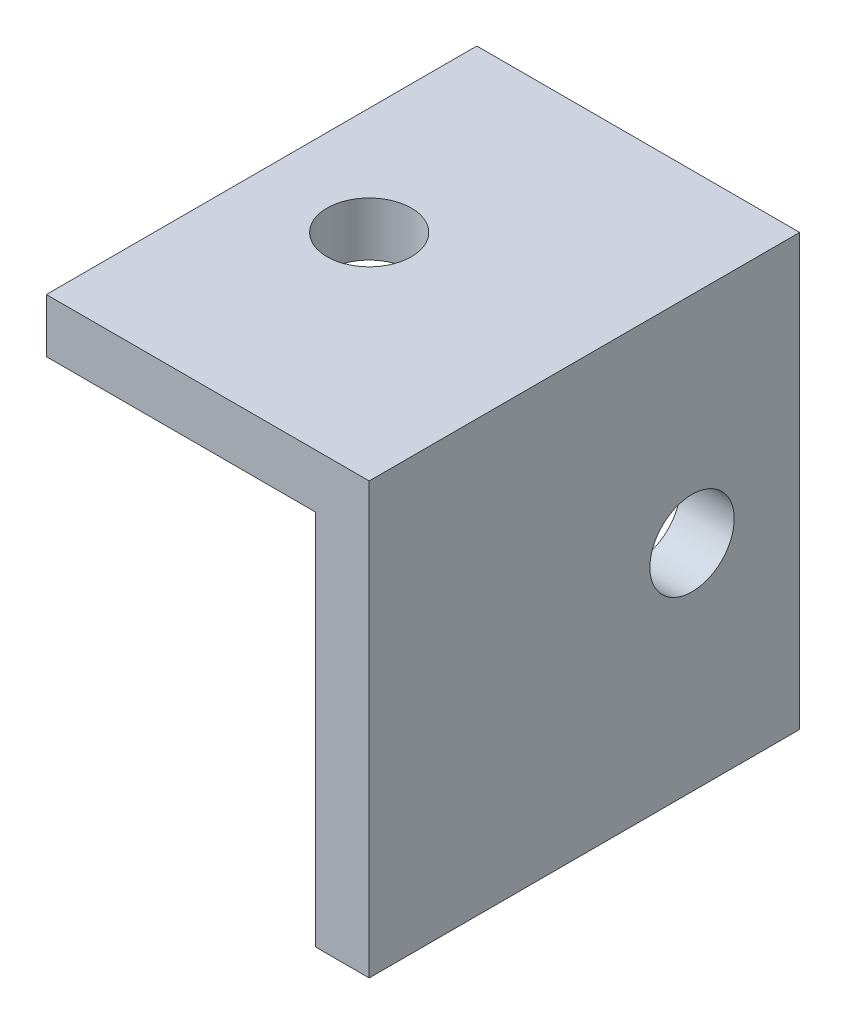
ISO-10303-21;
HEADER;
FILE_DESCRIPTION(('STEP AP214'),'2;1');
FILE_NAME('part.step','',(''),(''),'','','');
FILE_SCHEMA(('AUTOMOTIVE_DESIGN { 1 0 10303 214 1 1 1 1 }'));
ENDSEC;
DATA;
#1=APPLICATION_CONTEXT('core data for automotive mechanical design processes');
#2=APPLICATION_PROTOCOL_DEFINITION('international standard','automotive_design',2000,#1);
#3=PRODUCT_CONTEXT('',#1,'mechanical');
#4=PRODUCT('Part','Part','',(#3));
#5=PRODUCT_RELATED_PRODUCT_CATEGORY('part','',(#4));
#6=PRODUCT_DEFINITION_FORMATION('','',#4);
#7=PRODUCT_DEFINITION_CONTEXT('part definition',#1,'design');
#8=PRODUCT_DEFINITION('design','',#6,#7);
#9=PRODUCT_DEFINITION_SHAPE('','',#8);
#10=(LENGTH_UNIT() NAMED_UNIT(*) SI_UNIT(.MILLI.,.METRE.));
#11=(NAMED_UNIT(*) PLANE_ANGLE_UNIT() SI_UNIT($,.RADIAN.));
#12=(NAMED_UNIT(*) SI_UNIT($,.STERADIAN.) SOLID_ANGLE_UNIT());
#13=UNCERTAINTY_MEASURE_WITH_UNIT(LENGTH_MEASURE(1.E-05),#10,'distance_accuracy_value','');
#14=(GEOMETRIC_REPRESENTATION_CONTEXT(3) GLOBAL_UNCERTAINTY_ASSIGNED_CONTEXT((#13)) GLOBAL_UNIT_ASSIGNED_CONTEXT((#10,
#11,#12)) REPRESENTATION_CONTEXT('',''));
#15=CARTESIAN_POINT('',(0.,0.,0.));
#16=DIRECTION('',(0.,0.,1.));
#17=DIRECTION('',(1.,0.,0.));
#18=AXIS2_PLACEMENT_3D('',#15,#16,#17);
#19=CARTESIAN_POINT('',(-524.51,-3.17499999999915,-25.4));
#20=DIRECTION('',(0.,-1.,0.));
#21=DIRECTION('',(1.,0.,0.));
#22=AXIS2_PLACEMENT_3D('',#19,#20,#21);
#23=PLANE('',#22);
#24=CARTESIAN_POINT('',(-537.21,-3.17499999999961,-12.7));
#25=DIRECTION('',(0.,-1.,0.));
#26=DIRECTION('',(0.,0.,-1.));
#27=AXIS2_PLACEMENT_3D('',#24,#25,#26);
#28=CIRCLE('',#27,2.48919999999997);
#29=CARTESIAN_POINT('',(-537.21,-3.17499999999961,-15.1892));
#30=VERTEX_POINT('',#29);
#31=EDGE_CURVE('E239',#30,#30,#28,.T.);
#32=ORIENTED_EDGE('',*,*,#31,.F.);
#33=EDGE_LOOP('',(#32));
#34=FACE_BOUND('',#33,.T.);
#35=DIRECTION('',(1.,0.,0.));
#36=VECTOR('',#35,1.);
#37=CARTESIAN_POINT('',(-524.51,-3.17499999999915,0.));
#38=LINE('',#37,#36);
#39=CARTESIAN_POINT('',(-543.56,-3.17499999999984,0.));
#40=VERTEX_POINT('',#39);
#41=CARTESIAN_POINT('',(-527.685,-3.17499999999926,0.));
#42=VERTEX_POINT('',#41);
#43=EDGE_CURVE('E80',#40,#42,#38,.T.);
#44=ORIENTED_EDGE('',*,*,#43,.F.);
#45=DIRECTION('',(0.,0.,1.));
#46=VECTOR('',#45,1.);
#47=CARTESIAN_POINT('',(-543.56,-3.17499999999984,-25.4));
#48=LINE('',#47,#46);
#49=CARTESIAN_POINT('',(-543.56,-3.17499999999984,-25.4));
#50=VERTEX_POINT('',#49);
#51=EDGE_CURVE('E51',#50,#40,#48,.T.);
#52=ORIENTED_EDGE('',*,*,#51,.F.);
#53=DIRECTION('',(1.,0.,0.));
#54=VECTOR('',#53,1.);
#55=CARTESIAN_POINT('',(-524.51,-3.17499999999915,-25.4));
#56=LINE('',#55,#54);
#57=CARTESIAN_POINT('',(-527.685,-3.17499999999926,-25.4));
#58=VERTEX_POINT('',#57);
#59=EDGE_CURVE('E58',#50,#58,#56,.T.);
#60=ORIENTED_EDGE('',*,*,#59,.T.);
#61=DIRECTION('',(0.,0.,1.));
#62=VECTOR('',#61,1.);
#63=CARTESIAN_POINT('',(-527.685,-3.17499999999926,-25.4));
#64=LINE('',#63,#62);
#65=EDGE_CURVE('E11',#58,#42,#64,.T.);
#66=ORIENTED_EDGE('',*,*,#65,.T.);
#67=EDGE_LOOP('',(#44,#52,#60,#66));
#68=FACE_BOUND('',#67,.T.);
#69=ADVANCED_FACE('F34',(#34,#68),#23,.T.);
#70=CARTESIAN_POINT('',(-524.51,8.51046863044835E-13,-25.4));
#71=DIRECTION('',(0.,-1.,0.));
#72=DIRECTION('',(1.,0.,0.));
#73=AXIS2_PLACEMENT_3D('',#70,#71,#72);
#74=PLANE('',#73);
#75=CARTESIAN_POINT('',(-537.21,3.92914867308747E-13,-12.7));
#76=DIRECTION('',(0.,-1.,0.));
#77=DIRECTION('',(1.,0.,0.));
#78=AXIS2_PLACEMENT_3D('',#75,#76,#77);
#79=CIRCLE('',#78,2.48919999999997);
#80=CARTESIAN_POINT('',(-534.7208,4.826750429363E-13,-12.7));
#81=VERTEX_POINT('',#80);
#82=EDGE_CURVE('E237',#81,#81,#79,.T.);
#83=ORIENTED_EDGE('',*,*,#82,.T.);
#84=EDGE_LOOP('',(#83));
#85=FACE_BOUND('',#84,.T.);
#86=DIRECTION('',(0.,0.,-1.));
#87=VECTOR('',#86,1.);
#88=CARTESIAN_POINT('',(-543.56,1.57171308505023E-13,0.));
#89=LINE('',#88,#87);
#90=CARTESIAN_POINT('',(-543.56,1.57171308505023E-13,0.));
#91=VERTEX_POINT('',#90);
#92=CARTESIAN_POINT('',(-543.56,1.57171308505023E-13,-25.4));
#93=VERTEX_POINT('',#92);
#94=EDGE_CURVE('E98',#91,#93,#89,.T.);
#95=ORIENTED_EDGE('',*,*,#94,.F.);
#96=DIRECTION('',(1.,0.,0.));
#97=VECTOR('',#96,1.);
#98=CARTESIAN_POINT('',(-524.51,8.51046863044835E-13,0.));
#99=LINE('',#98,#97);
#100=CARTESIAN_POINT('',(-524.51,8.51046863044835E-13,0.));
#101=VERTEX_POINT('',#100);
#102=EDGE_CURVE('E106',#91,#101,#99,.T.);
#103=ORIENTED_EDGE('',*,*,#102,.T.);
#104=DIRECTION('',(0.,0.,1.));
#105=VECTOR('',#104,1.);
#106=CARTESIAN_POINT('',(-524.51,8.51046863044835E-13,-25.4));
#107=LINE('',#106,#105);
#108=CARTESIAN_POINT('',(-524.51,8.51046863044835E-13,-25.4));
#109=VERTEX_POINT('',#108);
#110=EDGE_CURVE('E43',#109,#101,#107,.T.);
#111=ORIENTED_EDGE('',*,*,#110,.F.);
#112=DIRECTION('',(1.,0.,0.));
#113=VECTOR('',#112,1.);
#114=CARTESIAN_POINT('',(-524.51,8.51046863044835E-13,-25.4));
#115=LINE('',#114,#113);
#116=EDGE_CURVE('E108',#93,#109,#115,.T.);
#117=ORIENTED_EDGE('',*,*,#116,.F.);
#118=EDGE_LOOP('',(#95,#103,#111,#117));
#119=FACE_BOUND('',#118,.T.);
#120=ADVANCED_FACE('F104',(#85,#119),#74,.F.);
#121=CARTESIAN_POINT('',(0.,0.,-25.4));
#122=DIRECTION('',(0.,0.,1.));
#123=DIRECTION('',(1.,0.,0.));
#124=AXIS2_PLACEMENT_3D('',#121,#122,#123);
#125=PLANE('',#124);
#126=DIRECTION('',(0.,-1.,0.));
#127=VECTOR('',#126,1.);
#128=CARTESIAN_POINT('',(-543.56,1.57171308505023E-13,-25.4));
#129=LINE('',#128,#127);
#130=EDGE_CURVE('E109',#93,#50,#129,.T.);
#131=ORIENTED_EDGE('',*,*,#130,.F.);
#132=ORIENTED_EDGE('',*,*,#116,.T.);
#133=DIRECTION('',(0.,-1.,0.));
#134=VECTOR('',#133,1.);
#135=CARTESIAN_POINT('',(-524.51,8.51046863044835E-13,-25.4));
#136=LINE('',#135,#134);
#137=CARTESIAN_POINT('',(-524.51,-25.3999999999991,-25.4));
#138=VERTEX_POINT('',#137);
#139=EDGE_CURVE('E131',#109,#138,#136,.T.);
#140=ORIENTED_EDGE('',*,*,#139,.T.);
#141=DIRECTION('',(-1.,0.,0.));
#142=VECTOR('',#141,1.);
#143=CARTESIAN_POINT('',(-524.51,-25.3999999999991,-25.4));
#144=LINE('',#143,#142);
#145=CARTESIAN_POINT('',(-527.685,-25.3999999999991,-25.4));
#146=VERTEX_POINT('',#145);
#147=EDGE_CURVE('E87',#138,#146,#144,.T.);
#148=ORIENTED_EDGE('',*,*,#147,.T.);
#149=DIRECTION('',(0.,1.,0.));
#150=VECTOR('',#149,1.);
#151=CARTESIAN_POINT('',(-527.685,8.51046863044835E-13,-25.4));
#152=LINE('',#151,#150);
#153=EDGE_CURVE('E116',#58,#146,#152,.F.);
#154=ORIENTED_EDGE('',*,*,#153,.F.);
#155=ORIENTED_EDGE('',*,*,#59,.F.);
#156=EDGE_LOOP('',(#131,#132,#140,#148,#154,#155));
#157=FACE_BOUND('',#156,.T.);
#158=ADVANCED_FACE('F138',(#157),#125,.F.);
#159=CARTESIAN_POINT('',(0.,0.,0.));
#160=DIRECTION('',(0.,0.,1.));
#161=DIRECTION('',(1.,0.,0.));
#162=AXIS2_PLACEMENT_3D('',#159,#160,#161);
#163=PLANE('',#162);
#164=ORIENTED_EDGE('',*,*,#102,.F.);
#165=DIRECTION('',(0.,1.,0.));
#166=VECTOR('',#165,1.);
#167=CARTESIAN_POINT('',(-543.56,-3.17499999999984,0.));
#168=LINE('',#167,#166);
#169=EDGE_CURVE('E95',#40,#91,#168,.T.);
#170=ORIENTED_EDGE('',*,*,#169,.F.);
#171=ORIENTED_EDGE('',*,*,#43,.T.);
#172=DIRECTION('',(0.,1.,0.));
#173=VECTOR('',#172,1.);
#174=CARTESIAN_POINT('',(-527.685,8.51046863044835E-13,0.));
#175=LINE('',#174,#173);
#176=CARTESIAN_POINT('',(-527.685,-25.3999999999991,0.));
#177=VERTEX_POINT('',#176);
#178=EDGE_CURVE('E135',#42,#177,#175,.F.);
#179=ORIENTED_EDGE('',*,*,#178,.T.);
#180=DIRECTION('',(-1.,0.,0.));
#181=VECTOR('',#180,1.);
#182=CARTESIAN_POINT('',(-524.51,-25.3999999999991,0.));
#183=LINE('',#182,#181);
#184=CARTESIAN_POINT('',(-524.51,-25.3999999999991,0.));
#185=VERTEX_POINT('',#184);
#186=EDGE_CURVE('E118',#185,#177,#183,.T.);
#187=ORIENTED_EDGE('',*,*,#186,.F.);
#188=DIRECTION('',(0.,-1.,0.));
#189=VECTOR('',#188,1.);
#190=CARTESIAN_POINT('',(-524.51,8.51046863044835E-13,0.));
#191=LINE('',#190,#189);
#192=EDGE_CURVE('E114',#101,#185,#191,.T.);
#193=ORIENTED_EDGE('',*,*,#192,.F.);
#194=EDGE_LOOP('',(#164,#170,#171,#179,#187,#193));
#195=FACE_BOUND('',#194,.T.);
#196=ADVANCED_FACE('F112',(#195),#163,.T.);
#197=CARTESIAN_POINT('',(-527.685,8.51046863044835E-13,-25.4));
#198=DIRECTION('',(-1.,0.,0.));
#199=DIRECTION('',(0.,0.,1.));
#200=AXIS2_PLACEMENT_3D('',#197,#198,#199);
#201=PLANE('',#200);
#202=CARTESIAN_POINT('',(-527.685,-12.6999999999992,-19.05));
#203=DIRECTION('',(-1.,0.,0.));
#204=DIRECTION('',(0.,0.,1.));
#205=AXIS2_PLACEMENT_3D('',#202,#203,#204);
#206=CIRCLE('',#205,2.48919999999999);
#207=CARTESIAN_POINT('',(-527.685,-12.6999999999992,-16.5608));
#208=VERTEX_POINT('',#207);
#209=EDGE_CURVE('E241',#208,#208,#206,.T.);
#210=ORIENTED_EDGE('',*,*,#209,.F.);
#211=EDGE_LOOP('',(#210));
#212=FACE_BOUND('',#211,.T.);
#213=ORIENTED_EDGE('',*,*,#178,.F.);
#214=ORIENTED_EDGE('',*,*,#65,.F.);
#215=ORIENTED_EDGE('',*,*,#153,.T.);
#216=DIRECTION('',(0.,0.,1.));
#217=VECTOR('',#216,1.);
#218=CARTESIAN_POINT('',(-527.685,-25.3999999999991,-25.4));
#219=LINE('',#218,#217);
#220=EDGE_CURVE('E38',#146,#177,#219,.T.);
#221=ORIENTED_EDGE('',*,*,#220,.T.);
#222=EDGE_LOOP('',(#213,#214,#215,#221));
#223=FACE_BOUND('',#222,.T.);
#224=ADVANCED_FACE('F36',(#212,#223),#201,.T.);
#225=CARTESIAN_POINT('',(-524.51,8.51046863044835E-13,-25.4));
#226=DIRECTION('',(-1.,0.,0.));
#227=DIRECTION('',(0.,0.,1.));
#228=AXIS2_PLACEMENT_3D('',#225,#226,#227);
#229=PLANE('',#228);
#230=CARTESIAN_POINT('',(-524.51,-12.6999999999992,-19.05));
#231=DIRECTION('',(-1.,0.,0.));
#232=DIRECTION('',(0.,0.,1.));
#233=AXIS2_PLACEMENT_3D('',#230,#231,#232);
#234=CIRCLE('',#233,2.48919999999999);
#235=CARTESIAN_POINT('',(-524.51,-12.6999999999992,-16.5608));
#236=VERTEX_POINT('',#235);
#237=EDGE_CURVE('E136',#236,#236,#234,.T.);
#238=ORIENTED_EDGE('',*,*,#237,.T.);
#239=EDGE_LOOP('',(#238));
#240=FACE_BOUND('',#239,.T.);
#241=ORIENTED_EDGE('',*,*,#192,.T.);
#242=DIRECTION('',(0.,0.,1.));
#243=VECTOR('',#242,1.);
#244=CARTESIAN_POINT('',(-524.51,-25.3999999999991,-25.4));
#245=LINE('',#244,#243);
#246=EDGE_CURVE('E122',#138,#185,#245,.T.);
#247=ORIENTED_EDGE('',*,*,#246,.F.);
#248=ORIENTED_EDGE('',*,*,#139,.F.);
#249=ORIENTED_EDGE('',*,*,#110,.T.);
#250=EDGE_LOOP('',(#241,#247,#248,#249));
#251=FACE_BOUND('',#250,.T.);
#252=ADVANCED_FACE('F145',(#240,#251),#229,.F.);
#253=CARTESIAN_POINT('',(-524.51,-25.3999999999991,-25.4));
#254=DIRECTION('',(0.,1.,0.));
#255=DIRECTION('',(0.,0.,1.));
#256=AXIS2_PLACEMENT_3D('',#253,#254,#255);
#257=PLANE('',#256);
#258=ORIENTED_EDGE('',*,*,#186,.T.);
#259=ORIENTED_EDGE('',*,*,#220,.F.);
#260=ORIENTED_EDGE('',*,*,#147,.F.);
#261=ORIENTED_EDGE('',*,*,#246,.T.);
#262=EDGE_LOOP('',(#258,#259,#260,#261));
#263=FACE_BOUND('',#262,.T.);
#264=ADVANCED_FACE('F137',(#263),#257,.F.);
#265=CARTESIAN_POINT('',(-527.685,-12.6999999999992,-19.05));
#266=DIRECTION('',(-1.,0.,0.));
#267=DIRECTION('',(0.,0.,1.));
#268=AXIS2_PLACEMENT_3D('',#265,#266,#267);
#269=CYLINDRICAL_SURFACE('',#268,2.48919999999999);
#270=ORIENTED_EDGE('',*,*,#237,.F.);
#271=EDGE_LOOP('',(#270));
#272=FACE_BOUND('',#271,.T.);
#273=ORIENTED_EDGE('',*,*,#209,.T.);
#274=EDGE_LOOP('',(#273));
#275=FACE_BOUND('',#274,.T.);
#276=ADVANCED_FACE('F153',(#272,#275),#269,.F.);
#277=CARTESIAN_POINT('',(-537.21,-3.17499999999961,-12.7));
#278=DIRECTION('',(0.,-1.,0.));
#279=DIRECTION('',(0.,0.,-1.));
#280=AXIS2_PLACEMENT_3D('',#277,#278,#279);
#281=CYLINDRICAL_SURFACE('',#280,2.48919999999997);
#282=ORIENTED_EDGE('',*,*,#82,.F.);
#283=EDGE_LOOP('',(#282));
#284=FACE_BOUND('',#283,.T.);
#285=ORIENTED_EDGE('',*,*,#31,.T.);
#286=EDGE_LOOP('',(#285));
#287=FACE_BOUND('',#286,.T.);
#288=ADVANCED_FACE('F172',(#284,#287),#281,.F.);
#289=CARTESIAN_POINT('',(-543.56,-1.90070181815827E-11,0.));
#290=DIRECTION('',(-1.,0.,0.));
#291=DIRECTION('',(0.,-1.,0.));
#292=AXIS2_PLACEMENT_3D('',#289,#290,#291);
#293=PLANE('',#292);
#294=ORIENTED_EDGE('',*,*,#51,.T.);
#295=ORIENTED_EDGE('',*,*,#169,.T.);
#296=ORIENTED_EDGE('',*,*,#94,.T.);
#297=ORIENTED_EDGE('',*,*,#130,.T.);
#298=EDGE_LOOP('',(#294,#295,#296,#297));
#299=FACE_BOUND('',#298,.T.);
#300=ADVANCED_FACE('F97',(#299),#293,.T.);
#301=CLOSED_SHELL('',(#69,#120,#158,#196,#224,#252,#264,#276,#288,#300));
#302=MANIFOLD_SOLID_BREP('B2',#301);
#303=ADVANCED_BREP_SHAPE_REPRESENTATION('',(#18,#302),#14);
#304=SHAPE_DEFINITION_REPRESENTATION(#9,#303);
ENDSEC;
END-ISO-10303-21;
